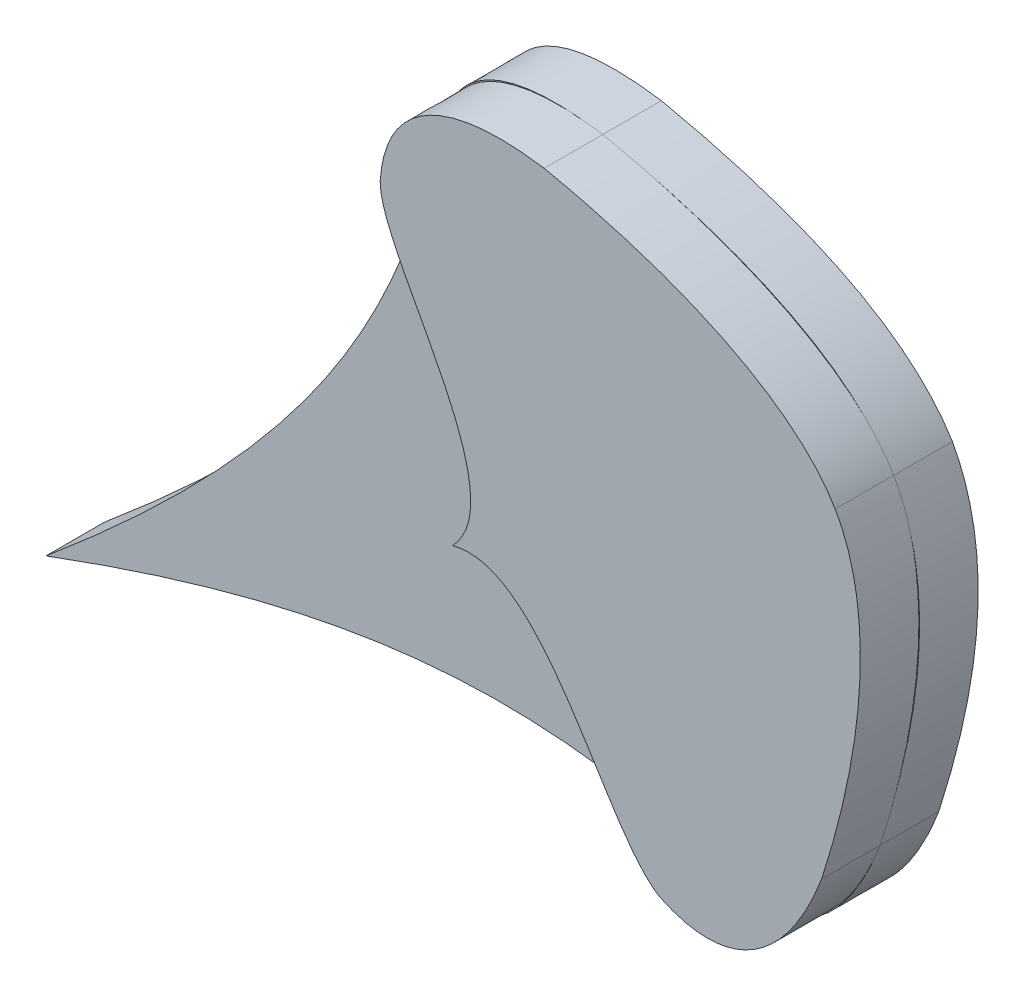
ISO-10303-21;
HEADER;
FILE_DESCRIPTION(('STEP AP214'),'2;1');
FILE_NAME('part.step','',(''),(''),'','','');
FILE_SCHEMA(('AUTOMOTIVE_DESIGN { 1 0 10303 214 1 1 1 1 }'));
ENDSEC;
DATA;
#1=APPLICATION_CONTEXT('core data for automotive mechanical design processes');
#2=APPLICATION_PROTOCOL_DEFINITION('international standard','automotive_design',2000,#1);
#3=PRODUCT_CONTEXT('',#1,'mechanical');
#4=PRODUCT('Part','Part','',(#3));
#5=PRODUCT_RELATED_PRODUCT_CATEGORY('part','',(#4));
#6=PRODUCT_DEFINITION_FORMATION('','',#4);
#7=PRODUCT_DEFINITION_CONTEXT('part definition',#1,'design');
#8=PRODUCT_DEFINITION('design','',#6,#7);
#9=PRODUCT_DEFINITION_SHAPE('','',#8);
#10=(LENGTH_UNIT() NAMED_UNIT(*) SI_UNIT(.MILLI.,.METRE.));
#11=(NAMED_UNIT(*) PLANE_ANGLE_UNIT() SI_UNIT($,.RADIAN.));
#12=(NAMED_UNIT(*) SI_UNIT($,.STERADIAN.) SOLID_ANGLE_UNIT());
#13=UNCERTAINTY_MEASURE_WITH_UNIT(LENGTH_MEASURE(1.E-05),#10,'distance_accuracy_value','');
#14=(GEOMETRIC_REPRESENTATION_CONTEXT(3) GLOBAL_UNCERTAINTY_ASSIGNED_CONTEXT((#13)) GLOBAL_UNIT_ASSIGNED_CONTEXT((#10,
#11,#12)) REPRESENTATION_CONTEXT('',''));
#15=CARTESIAN_POINT('',(0.,0.,0.));
#16=DIRECTION('',(0.,0.,1.));
#17=DIRECTION('',(1.,0.,0.));
#18=AXIS2_PLACEMENT_3D('',#15,#16,#17);
#19=CARTESIAN_POINT('',(1091.5346594344,817.810461858277,10.));
#20=DIRECTION('',(0.,0.,1.));
#21=DIRECTION('',(1.,0.,0.));
#22=AXIS2_PLACEMENT_3D('',#19,#20,#21);
#23=PLANE('',#22);
#24=CARTESIAN_POINT('',(1084.89126533636,784.788556570693,10.));
#25=CARTESIAN_POINT('',(1093.52222440277,811.75798322808,10.));
#26=CARTESIAN_POINT('',(1093.01439360262,830.735257407287,10.));
#27=CARTESIAN_POINT('',(1087.18778082483,840.595865039812,10.));
#28=B_SPLINE_CURVE_WITH_KNOTS('',3,(#24,#25,#26,#27),.UNSPECIFIED.,.F.,.F.,(4,4),(0.,1.),.UNSPECIFIED.);
#29=CARTESIAN_POINT('',(1086.50027911747,790.087891008953,10.));
#30=VERTEX_POINT('',#29);
#31=CARTESIAN_POINT('',(1090.06138700975,833.416297835862,10.));
#32=VERTEX_POINT('',#31);
#33=EDGE_CURVE('E11',#30,#32,#28,.T.);
#34=ORIENTED_EDGE('',*,*,#33,.F.);
#35=CARTESIAN_POINT('',(1084.89126533636,784.788556570693,10.));
#36=CARTESIAN_POINT('',(1097.0297957882,822.928712911301,10.));
#37=CARTESIAN_POINT('',(1087.18778082483,840.595865039812,10.));
#38=B_SPLINE_CURVE_WITH_KNOTS('',2,(#35,#36,#37),.UNSPECIFIED.,.F.,.F.,(3,3),(0.,1.),.UNSPECIFIED.);
#39=EDGE_CURVE('E39',#30,#32,#38,.T.);
#40=ORIENTED_EDGE('',*,*,#39,.T.);
#41=EDGE_LOOP('',(#34,#40));
#42=FACE_BOUND('',#41,.T.);
#43=ADVANCED_FACE('F33',(#42),#23,.T.);
#44=CARTESIAN_POINT('',(1057.30158871609,768.260369991355,10.));
#45=CARTESIAN_POINT('',(1068.39381800838,762.911936442552,10.));
#46=CARTESIAN_POINT('',(1078.57410115042,768.238078014027,10.));
#47=CARTESIAN_POINT('',(1084.89126533636,784.788556570693,10.));
#48=B_SPLINE_CURVE_WITH_KNOTS('',3,(#44,#45,#46,#47),.UNSPECIFIED.,.F.,.F.,(4,4),(0.,1.),.UNSPECIFIED.);
#49=CARTESIAN_POINT('',(1063.62607334976,766.357587399792,10.));
#50=VERTEX_POINT('',#49);
#51=CARTESIAN_POINT('',(1083.83897315551,782.215562819125,10.));
#52=VERTEX_POINT('',#51);
#53=EDGE_CURVE('E44',#50,#52,#48,.T.);
#54=ORIENTED_EDGE('',*,*,#53,.F.);
#55=CARTESIAN_POINT('',(1057.30158871609,768.260369991355,10.));
#56=CARTESIAN_POINT('',(1075.36566558913,760.045488284607,10.));
#57=CARTESIAN_POINT('',(1084.89126533636,784.788556570693,10.));
#58=B_SPLINE_CURVE_WITH_KNOTS('',2,(#55,#56,#57),.UNSPECIFIED.,.F.,.F.,(3,3),(0.,1.),.UNSPECIFIED.);
#59=EDGE_CURVE('E414',#50,#52,#58,.T.);
#60=ORIENTED_EDGE('',*,*,#59,.T.);
#61=EDGE_LOOP('',(#54,#60));
#62=FACE_BOUND('',#61,.T.);
#63=ADVANCED_FACE('F484',(#62),#23,.T.);
#64=CARTESIAN_POINT('',(1021.86335653294,802.554480195239,10.));
#65=CARTESIAN_POINT('',(1037.75529903201,806.75725398034,10.));
#66=CARTESIAN_POINT('',(1047.91521963167,773.390697705357,10.));
#67=CARTESIAN_POINT('',(1057.30158871609,768.260369991355,10.));
#68=B_SPLINE_CURVE_WITH_KNOTS('',3,(#64,#65,#66,#67),.UNSPECIFIED.,.F.,.F.,(4,4),(0.,1.),.UNSPECIFIED.);
#69=CARTESIAN_POINT('',(1021.86335653294,802.554480195239,10.));
#70=VERTEX_POINT('',#69);
#71=CARTESIAN_POINT('',(1057.30158871609,768.260369991355,10.));
#72=VERTEX_POINT('',#71);
#73=EDGE_CURVE('E51',#70,#72,#68,.T.);
#74=ORIENTED_EDGE('',*,*,#73,.F.);
#75=CARTESIAN_POINT('',(1009.52557635658,850.301034785731,10.));
#76=CARTESIAN_POINT('',(1009.35534743589,839.605465181608,10.));
#77=CARTESIAN_POINT('',(1033.36152518063,814.30221451433,10.));
#78=CARTESIAN_POINT('',(1021.86335653294,802.554480195239,10.));
#79=B_SPLINE_CURVE_WITH_KNOTS('',3,(#75,#76,#77,#78),.UNSPECIFIED.,.F.,.F.,(4,4),(0.,1.),.UNSPECIFIED.);
#80=CARTESIAN_POINT('',(1009.52557635658,850.301034785731,10.));
#81=VERTEX_POINT('',#80);
#82=EDGE_CURVE('E449',#81,#70,#79,.T.);
#83=ORIENTED_EDGE('',*,*,#82,.F.);
#84=CARTESIAN_POINT('',(1009.52557635658,850.301034785731,10.));
#85=CARTESIAN_POINT('',(1001.90734281833,820.670179881632,10.));
#86=CARTESIAN_POINT('',(988.206449115251,794.709110120853,10.));
#87=CARTESIAN_POINT('',(942.482736762988,756.327533098448,10.));
#88=B_SPLINE_CURVE_WITH_KNOTS('',3,(#84,#85,#86,#87),.UNSPECIFIED.,.F.,.F.,(4,4),(0.,1.),.UNSPECIFIED.);
#89=CARTESIAN_POINT('',(942.482736762988,756.327533098448,10.));
#90=VERTEX_POINT('',#89);
#91=EDGE_CURVE('E270',#81,#90,#88,.T.);
#92=ORIENTED_EDGE('',*,*,#91,.T.);
#93=CARTESIAN_POINT('',(942.482736762988,756.327533098448,10.));
#94=CARTESIAN_POINT('',(998.429870334372,777.153516175964,10.));
#95=CARTESIAN_POINT('',(1027.77078121499,776.257647835978,10.));
#96=CARTESIAN_POINT('',(1057.30158871609,768.260369991355,10.));
#97=B_SPLINE_CURVE_WITH_KNOTS('',3,(#93,#94,#95,#96),.UNSPECIFIED.,.F.,.F.,(4,4),(0.,1.),.UNSPECIFIED.);
#98=EDGE_CURVE('E415',#90,#72,#97,.T.);
#99=ORIENTED_EDGE('',*,*,#98,.T.);
#100=EDGE_LOOP('',(#74,#83,#92,#99));
#101=FACE_BOUND('',#100,.T.);
#102=ADVANCED_FACE('F486',(#101),#23,.T.);
#103=CARTESIAN_POINT('',(1037.51660506411,866.14002211152,10.));
#104=CARTESIAN_POINT('',(1020.00440956792,868.813580173374,10.));
#105=CARTESIAN_POINT('',(1010.34797100117,862.587896026391,10.));
#106=CARTESIAN_POINT('',(1009.52557635658,850.301034785731,10.));
#107=B_SPLINE_CURVE_WITH_KNOTS('',3,(#103,#104,#105,#106),.UNSPECIFIED.,.F.,.F.,(4,4),(0.,1.),.UNSPECIFIED.);
#108=CARTESIAN_POINT('',(1034.75945290657,866.494603076725,10.));
#109=VERTEX_POINT('',#108);
#110=CARTESIAN_POINT('',(1010.99185469306,856.740733172445,10.));
#111=VERTEX_POINT('',#110);
#112=EDGE_CURVE('E304',#109,#111,#107,.T.);
#113=ORIENTED_EDGE('',*,*,#112,.F.);
#114=CARTESIAN_POINT('',(1037.51660506411,866.14002211152,10.));
#115=CARTESIAN_POINT('',(1011.29559215513,870.066211202949,10.));
#116=CARTESIAN_POINT('',(1009.52557635658,850.301034785731,10.));
#117=B_SPLINE_CURVE_WITH_KNOTS('',2,(#114,#115,#116),.UNSPECIFIED.,.F.,.F.,(3,3),(0.,1.),.UNSPECIFIED.);
#118=EDGE_CURVE('E300',#109,#111,#117,.T.);
#119=ORIENTED_EDGE('',*,*,#118,.T.);
#120=EDGE_LOOP('',(#113,#119));
#121=FACE_BOUND('',#120,.T.);
#122=ADVANCED_FACE('F478',(#121),#23,.T.);
#123=DIRECTION('',(0.,0.,-1.));
#124=VECTOR('',#123,1.);
#125=SURFACE_OF_LINEAR_EXTRUSION('',#38,#124);
#126=CARTESIAN_POINT('',(1084.89126533636,784.788556570693,0.));
#127=CARTESIAN_POINT('',(1097.0297957882,822.928712911301,0.));
#128=CARTESIAN_POINT('',(1087.18778082483,840.595865039812,0.));
#129=B_SPLINE_CURVE_WITH_KNOTS('',2,(#126,#127,#128),.UNSPECIFIED.,.F.,.F.,(3,3),(0.,1.),.UNSPECIFIED.);
#130=CARTESIAN_POINT('',(1084.89126533636,784.788556570693,0.));
#131=VERTEX_POINT('',#130);
#132=CARTESIAN_POINT('',(1087.18778082483,840.595865039812,0.));
#133=VERTEX_POINT('',#132);
#134=EDGE_CURVE('E165',#131,#133,#129,.T.);
#135=ORIENTED_EDGE('',*,*,#134,.T.);
#136=DIRECTION('',(0.,0.,-1.));
#137=VECTOR('',#136,1.);
#138=CARTESIAN_POINT('',(1087.18778082483,840.595865039812,10.));
#139=LINE('',#138,#137);
#140=CARTESIAN_POINT('',(1087.18778082483,840.595865039812,10.));
#141=VERTEX_POINT('',#140);
#142=EDGE_CURVE('E377',#141,#133,#139,.T.);
#143=ORIENTED_EDGE('',*,*,#142,.F.);
#144=EDGE_CURVE('E179',#32,#141,#38,.T.);
#145=ORIENTED_EDGE('',*,*,#144,.F.);
#146=ORIENTED_EDGE('',*,*,#39,.F.);
#147=CARTESIAN_POINT('',(1084.89126533636,784.788556570693,10.));
#148=CARTESIAN_POINT('',(1085.46803325688,786.590801258792,10.));
#149=CARTESIAN_POINT('',(1086.00399059692,788.357355840586,10.));
#150=CARTESIAN_POINT('',(1086.50027731851,790.087884739982,10.));
#151=B_SPLINE_CURVE_WITH_KNOTS('',3,(#147,#148,#149,#150),.UNSPECIFIED.,.F.,.F.,(4,4),(0.,
0.0668254728212872),.UNSPECIFIED.);
#152=CARTESIAN_POINT('',(1084.89126533636,784.788556570693,10.));
#153=VERTEX_POINT('',#152);
#154=EDGE_CURVE('E251',#153,#30,#151,.T.);
#155=ORIENTED_EDGE('',*,*,#154,.F.);
#156=DIRECTION('',(0.,0.,-1.));
#157=VECTOR('',#156,1.);
#158=CARTESIAN_POINT('',(1084.89126533636,784.788556570693,10.));
#159=LINE('',#158,#157);
#160=EDGE_CURVE('E413',#153,#131,#159,.T.);
#161=ORIENTED_EDGE('',*,*,#160,.T.);
#162=EDGE_LOOP('',(#135,#143,#145,#146,#155,#161));
#163=FACE_BOUND('',#162,.T.);
#164=ADVANCED_FACE('F35',(#163),#125,.F.);
#165=CARTESIAN_POINT('',(1087.18778082483,840.595865039812,10.));
#166=CARTESIAN_POINT('',(1076.6791048201,857.874790107618,10.));
#167=CARTESIAN_POINT('',(1037.51660506411,866.14002211152,10.));
#168=B_SPLINE_CURVE_WITH_KNOTS('',2,(#165,#166,#167),.UNSPECIFIED.,.F.,.F.,(3,3),(0.,1.),.UNSPECIFIED.);
#169=DIRECTION('',(0.,0.,-1.));
#170=VECTOR('',#169,1.);
#171=SURFACE_OF_LINEAR_EXTRUSION('',#168,#170);
#172=CARTESIAN_POINT('',(1087.18778082483,840.595865039812,0.));
#173=CARTESIAN_POINT('',(1076.6791048201,857.874790107618,0.));
#174=CARTESIAN_POINT('',(1037.51660506411,866.14002211152,0.));
#175=B_SPLINE_CURVE_WITH_KNOTS('',2,(#172,#173,#174),.UNSPECIFIED.,.F.,.F.,(3,3),(0.,1.),.UNSPECIFIED.);
#176=CARTESIAN_POINT('',(1037.51660506411,866.14002211152,0.));
#177=VERTEX_POINT('',#176);
#178=EDGE_CURVE('E168',#133,#177,#175,.T.);
#179=ORIENTED_EDGE('',*,*,#178,.T.);
#180=DIRECTION('',(0.,0.,-1.));
#181=VECTOR('',#180,1.);
#182=CARTESIAN_POINT('',(1037.51660506411,866.14002211152,10.));
#183=LINE('',#182,#181);
#184=CARTESIAN_POINT('',(1037.51660506411,866.14002211152,10.));
#185=VERTEX_POINT('',#184);
#186=EDGE_CURVE('E379',#185,#177,#183,.T.);
#187=ORIENTED_EDGE('',*,*,#186,.F.);
#188=CARTESIAN_POINT('',(1042.91970533106,864.9241659903,10.));
#189=CARTESIAN_POINT('',(1041.16967299864,865.346561086032,10.));
#190=CARTESIAN_POINT('',(1039.36872981637,865.752232153277,10.));
#191=CARTESIAN_POINT('',(1037.51660506411,866.14002211152,10.));
#192=B_SPLINE_CURVE_WITH_KNOTS('',3,(#188,#189,#190,#191),.UNSPECIFIED.,.F.,.F.,(4,4),
(0.933174527181268,1.),.UNSPECIFIED.);
#193=CARTESIAN_POINT('',(1042.91970533106,864.9241659903,10.));
#194=VERTEX_POINT('',#193);
#195=EDGE_CURVE('E256',#194,#185,#192,.T.);
#196=ORIENTED_EDGE('',*,*,#195,.F.);
#197=CARTESIAN_POINT('',(1082.3615843341,846.638350056223,10.));
#198=VERTEX_POINT('',#197);
#199=EDGE_CURVE('E252',#198,#194,#168,.T.);
#200=ORIENTED_EDGE('',*,*,#199,.F.);
#201=EDGE_CURVE('E255',#141,#198,#168,.T.);
#202=ORIENTED_EDGE('',*,*,#201,.F.);
#203=ORIENTED_EDGE('',*,*,#142,.T.);
#204=EDGE_LOOP('',(#179,#187,#196,#200,#202,#203));
#205=FACE_BOUND('',#204,.T.);
#206=ADVANCED_FACE('F279',(#205),#171,.F.);
#207=DIRECTION('',(0.,0.,-1.));
#208=VECTOR('',#207,1.);
#209=SURFACE_OF_LINEAR_EXTRUSION('',#117,#208);
#210=CARTESIAN_POINT('',(1037.51660506411,866.14002211152,0.));
#211=CARTESIAN_POINT('',(1011.29559215513,870.066211202949,0.));
#212=CARTESIAN_POINT('',(1009.52557635658,850.301034785731,0.));
#213=B_SPLINE_CURVE_WITH_KNOTS('',2,(#210,#211,#212),.UNSPECIFIED.,.F.,.F.,(3,3),(0.,1.),.UNSPECIFIED.);
#214=CARTESIAN_POINT('',(1009.52557635658,850.301034785731,0.));
#215=VERTEX_POINT('',#214);
#216=EDGE_CURVE('E656',#177,#215,#213,.T.);
#217=ORIENTED_EDGE('',*,*,#216,.T.);
#218=DIRECTION('',(0.,0.,-1.));
#219=VECTOR('',#218,1.);
#220=CARTESIAN_POINT('',(1009.52557635658,850.301034785731,10.));
#221=LINE('',#220,#219);
#222=EDGE_CURVE('E382',#81,#215,#221,.T.);
#223=ORIENTED_EDGE('',*,*,#222,.F.);
#224=EDGE_CURVE('E265',#111,#81,#117,.T.);
#225=ORIENTED_EDGE('',*,*,#224,.F.);
#226=ORIENTED_EDGE('',*,*,#118,.F.);
#227=CARTESIAN_POINT('',(1037.51660506411,866.14002211152,10.));
#228=CARTESIAN_POINT('',(1036.57478185847,866.283808710113,10.));
#229=CARTESIAN_POINT('',(1035.65568060373,866.401855186343,10.));
#230=CARTESIAN_POINT('',(1034.75945347818,866.494603017862,10.));
#231=B_SPLINE_CURVE_WITH_KNOTS('',3,(#227,#228,#229,#230),.UNSPECIFIED.,.F.,.F.,(4,4),(0.,
0.0537809897023282),.UNSPECIFIED.);
#232=EDGE_CURVE('E303',#185,#109,#231,.T.);
#233=ORIENTED_EDGE('',*,*,#232,.F.);
#234=ORIENTED_EDGE('',*,*,#186,.T.);
#235=EDGE_LOOP('',(#217,#223,#225,#226,#233,#234));
#236=FACE_BOUND('',#235,.T.);
#237=ADVANCED_FACE('F283',(#236),#209,.F.);
#238=DIRECTION('',(0.,0.,-1.));
#239=VECTOR('',#238,1.);
#240=SURFACE_OF_LINEAR_EXTRUSION('',#88,#239);
#241=CARTESIAN_POINT('',(1009.52557635658,850.301034785731,0.));
#242=CARTESIAN_POINT('',(1001.90734281833,820.670179881632,0.));
#243=CARTESIAN_POINT('',(988.206449115251,794.709110120853,0.));
#244=CARTESIAN_POINT('',(942.482736762988,756.327533098448,0.));
#245=B_SPLINE_CURVE_WITH_KNOTS('',3,(#241,#242,#243,#244),.UNSPECIFIED.,.F.,.F.,(4,4),(0.,1.),.UNSPECIFIED.);
#246=CARTESIAN_POINT('',(942.482736762988,756.327533098448,0.));
#247=VERTEX_POINT('',#246);
#248=EDGE_CURVE('E648',#215,#247,#245,.T.);
#249=ORIENTED_EDGE('',*,*,#248,.T.);
#250=DIRECTION('',(0.,0.,-1.));
#251=VECTOR('',#250,1.);
#252=CARTESIAN_POINT('',(942.482736762988,756.327533098448,10.));
#253=LINE('',#252,#251);
#254=EDGE_CURVE('E651',#90,#247,#253,.T.);
#255=ORIENTED_EDGE('',*,*,#254,.F.);
#256=ORIENTED_EDGE('',*,*,#91,.F.);
#257=ORIENTED_EDGE('',*,*,#222,.T.);
#258=EDGE_LOOP('',(#249,#255,#256,#257));
#259=FACE_BOUND('',#258,.T.);
#260=ADVANCED_FACE('F615',(#259),#240,.F.);
#261=DIRECTION('',(0.,0.,-1.));
#262=VECTOR('',#261,1.);
#263=SURFACE_OF_LINEAR_EXTRUSION('',#97,#262);
#264=CARTESIAN_POINT('',(942.482736762988,756.327533098448,0.));
#265=CARTESIAN_POINT('',(998.429870334372,777.153516175964,0.));
#266=CARTESIAN_POINT('',(1027.77078121499,776.257647835978,0.));
#267=CARTESIAN_POINT('',(1057.30158871609,768.260369991355,0.));
#268=B_SPLINE_CURVE_WITH_KNOTS('',3,(#264,#265,#266,#267),.UNSPECIFIED.,.F.,.F.,(4,4),(0.,1.),.UNSPECIFIED.);
#269=CARTESIAN_POINT('',(1057.30158871609,768.260369991355,0.));
#270=VERTEX_POINT('',#269);
#271=EDGE_CURVE('E655',#247,#270,#268,.T.);
#272=ORIENTED_EDGE('',*,*,#271,.T.);
#273=DIRECTION('',(0.,0.,-1.));
#274=VECTOR('',#273,1.);
#275=CARTESIAN_POINT('',(1057.30158871609,768.260369991355,10.));
#276=LINE('',#275,#274);
#277=EDGE_CURVE('E428',#72,#270,#276,.T.);
#278=ORIENTED_EDGE('',*,*,#277,.F.);
#279=ORIENTED_EDGE('',*,*,#98,.F.);
#280=ORIENTED_EDGE('',*,*,#254,.T.);
#281=EDGE_LOOP('',(#272,#278,#279,#280));
#282=FACE_BOUND('',#281,.T.);
#283=ADVANCED_FACE('F405',(#282),#263,.F.);
#284=DIRECTION('',(0.,0.,-1.));
#285=VECTOR('',#284,1.);
#286=SURFACE_OF_LINEAR_EXTRUSION('',#58,#285);
#287=CARTESIAN_POINT('',(1057.30158871609,768.260369991355,0.));
#288=CARTESIAN_POINT('',(1075.36566558913,760.045488284607,0.));
#289=CARTESIAN_POINT('',(1084.89126533636,784.788556570693,0.));
#290=B_SPLINE_CURVE_WITH_KNOTS('',2,(#287,#288,#289),.UNSPECIFIED.,.F.,.F.,(3,3),(0.,1.),.UNSPECIFIED.);
#291=EDGE_CURVE('E185',#270,#131,#290,.T.);
#292=ORIENTED_EDGE('',*,*,#291,.T.);
#293=ORIENTED_EDGE('',*,*,#160,.F.);
#294=CARTESIAN_POINT('',(1083.8389733864,782.215563345292,10.));
#295=CARTESIAN_POINT('',(1084.20060498696,783.040819551687,10.));
#296=CARTESIAN_POINT('',(1084.55152199435,783.898455453928,10.));
#297=CARTESIAN_POINT('',(1084.89126533636,784.788556570693,10.));
#298=B_SPLINE_CURVE_WITH_KNOTS('',3,(#294,#295,#296,#297),.UNSPECIFIED.,.F.,.F.,(4,4),
(0.946219010301278,1.),.UNSPECIFIED.);
#299=EDGE_CURVE('E59',#52,#153,#298,.T.);
#300=ORIENTED_EDGE('',*,*,#299,.F.);
#301=ORIENTED_EDGE('',*,*,#59,.F.);
#302=EDGE_CURVE('E408',#72,#50,#58,.T.);
#303=ORIENTED_EDGE('',*,*,#302,.F.);
#304=ORIENTED_EDGE('',*,*,#277,.T.);
#305=EDGE_LOOP('',(#292,#293,#300,#301,#303,#304));
#306=FACE_BOUND('',#305,.T.);
#307=ADVANCED_FACE('F393',(#306),#286,.F.);
#308=CARTESIAN_POINT('',(1087.18778082483,840.595865039812,10.));
#309=CARTESIAN_POINT('',(1081.48711919672,850.529819758184,10.));
#310=CARTESIAN_POINT('',(1065.23245463665,860.336996081378,10.));
#311=CARTESIAN_POINT('',(1037.51660506411,866.14002211152,10.));
#312=B_SPLINE_CURVE_WITH_KNOTS('',3,(#308,#309,#310,#311),.UNSPECIFIED.,.F.,.F.,(4,4),(0.,1.),.UNSPECIFIED.);
#313=EDGE_CURVE('E257',#198,#194,#312,.T.);
#314=ORIENTED_EDGE('',*,*,#313,.F.);
#315=ORIENTED_EDGE('',*,*,#199,.T.);
#316=EDGE_LOOP('',(#314,#315));
#317=FACE_BOUND('',#316,.T.);
#318=ADVANCED_FACE('F404',(#317),#23,.T.);
#319=CARTESIAN_POINT('',(1091.5346594344,817.810461858277,0.));
#320=DIRECTION('',(0.,0.,1.));
#321=DIRECTION('',(1.,0.,0.));
#322=AXIS2_PLACEMENT_3D('',#319,#320,#321);
#323=PLANE('',#322);
#324=ORIENTED_EDGE('',*,*,#134,.F.);
#325=ORIENTED_EDGE('',*,*,#291,.F.);
#326=ORIENTED_EDGE('',*,*,#271,.F.);
#327=ORIENTED_EDGE('',*,*,#248,.F.);
#328=ORIENTED_EDGE('',*,*,#216,.F.);
#329=ORIENTED_EDGE('',*,*,#178,.F.);
#330=EDGE_LOOP('',(#324,#325,#326,#327,#328,#329));
#331=FACE_BOUND('',#330,.T.);
#332=ADVANCED_FACE('F406',(#331),#323,.F.);
#333=CARTESIAN_POINT('',(1091.46111252217,819.108017939576,10.));
#334=DIRECTION('',(0.,0.,1.));
#335=DIRECTION('',(1.,0.,0.));
#336=AXIS2_PLACEMENT_3D('',#333,#334,#335);
#337=PLANE('',#336);
#338=EDGE_CURVE('E163',#32,#141,#28,.T.);
#339=ORIENTED_EDGE('',*,*,#338,.F.);
#340=ORIENTED_EDGE('',*,*,#144,.T.);
#341=EDGE_LOOP('',(#339,#340));
#342=FACE_BOUND('',#341,.T.);
#343=ADVANCED_FACE('F209',(#342),#337,.F.);
#344=EDGE_CURVE('E229',#141,#198,#312,.T.);
#345=ORIENTED_EDGE('',*,*,#344,.F.);
#346=ORIENTED_EDGE('',*,*,#201,.T.);
#347=EDGE_LOOP('',(#345,#346));
#348=FACE_BOUND('',#347,.T.);
#349=ADVANCED_FACE('F475',(#348),#337,.F.);
#350=EDGE_CURVE('E447',#111,#81,#107,.T.);
#351=ORIENTED_EDGE('',*,*,#350,.F.);
#352=ORIENTED_EDGE('',*,*,#224,.T.);
#353=EDGE_LOOP('',(#351,#352));
#354=FACE_BOUND('',#353,.T.);
#355=ADVANCED_FACE('F498',(#354),#337,.F.);
#356=EDGE_CURVE('E157',#72,#50,#48,.T.);
#357=ORIENTED_EDGE('',*,*,#356,.F.);
#358=ORIENTED_EDGE('',*,*,#302,.T.);
#359=EDGE_LOOP('',(#357,#358));
#360=FACE_BOUND('',#359,.T.);
#361=ADVANCED_FACE('F496',(#360),#337,.F.);
#362=CARTESIAN_POINT('',(1084.89126533636,784.788556570693,20.));
#363=CARTESIAN_POINT('',(1093.52222440277,811.75798322808,20.));
#364=CARTESIAN_POINT('',(1093.01439360262,830.735257407287,20.));
#365=CARTESIAN_POINT('',(1087.18778082483,840.595865039812,20.));
#366=B_SPLINE_CURVE_WITH_KNOTS('',3,(#362,#363,#364,#365),.UNSPECIFIED.,.F.,.F.,(4,4),(0.,1.),.UNSPECIFIED.);
#367=DIRECTION('',(0.,0.,-1.));
#368=VECTOR('',#367,1.);
#369=SURFACE_OF_LINEAR_EXTRUSION('',#366,#368);
#370=ORIENTED_EDGE('',*,*,#154,.T.);
#371=ORIENTED_EDGE('',*,*,#33,.T.);
#372=ORIENTED_EDGE('',*,*,#338,.T.);
#373=DIRECTION('',(0.,0.,-1.));
#374=VECTOR('',#373,1.);
#375=CARTESIAN_POINT('',(1087.18778082483,840.595865039812,20.));
#376=LINE('',#375,#374);
#377=CARTESIAN_POINT('',(1087.18778082483,840.595865039812,20.));
#378=VERTEX_POINT('',#377);
#379=EDGE_CURVE('E141',#378,#141,#376,.T.);
#380=ORIENTED_EDGE('',*,*,#379,.F.);
#381=CARTESIAN_POINT('',(1084.89126533636,784.788556570693,20.));
#382=VERTEX_POINT('',#381);
#383=EDGE_CURVE('E148',#382,#378,#366,.T.);
#384=ORIENTED_EDGE('',*,*,#383,.F.);
#385=DIRECTION('',(0.,0.,-1.));
#386=VECTOR('',#385,1.);
#387=CARTESIAN_POINT('',(1084.89126533636,784.788556570693,20.));
#388=LINE('',#387,#386);
#389=EDGE_CURVE('E175',#382,#153,#388,.T.);
#390=ORIENTED_EDGE('',*,*,#389,.T.);
#391=EDGE_LOOP('',(#370,#371,#372,#380,#384,#390));
#392=FACE_BOUND('',#391,.T.);
#393=ADVANCED_FACE('F161',(#392),#369,.F.);
#394=CARTESIAN_POINT('',(1087.18778082483,840.595865039812,20.));
#395=CARTESIAN_POINT('',(1081.48711919672,850.529819758184,20.));
#396=CARTESIAN_POINT('',(1065.23245463665,860.336996081378,20.));
#397=CARTESIAN_POINT('',(1037.51660506411,866.14002211152,20.));
#398=B_SPLINE_CURVE_WITH_KNOTS('',3,(#394,#395,#396,#397),.UNSPECIFIED.,.F.,.F.,(4,4),(0.,1.),.UNSPECIFIED.);
#399=DIRECTION('',(0.,0.,-1.));
#400=VECTOR('',#399,1.);
#401=SURFACE_OF_LINEAR_EXTRUSION('',#398,#400);
#402=ORIENTED_EDGE('',*,*,#344,.T.);
#403=ORIENTED_EDGE('',*,*,#313,.T.);
#404=ORIENTED_EDGE('',*,*,#195,.T.);
#405=DIRECTION('',(0.,0.,-1.));
#406=VECTOR('',#405,1.);
#407=CARTESIAN_POINT('',(1037.51660506411,866.14002211152,20.));
#408=LINE('',#407,#406);
#409=CARTESIAN_POINT('',(1037.51660506411,866.14002211152,20.));
#410=VERTEX_POINT('',#409);
#411=EDGE_CURVE('E144',#410,#185,#408,.T.);
#412=ORIENTED_EDGE('',*,*,#411,.F.);
#413=EDGE_CURVE('E136',#378,#410,#398,.T.);
#414=ORIENTED_EDGE('',*,*,#413,.F.);
#415=ORIENTED_EDGE('',*,*,#379,.T.);
#416=EDGE_LOOP('',(#402,#403,#404,#412,#414,#415));
#417=FACE_BOUND('',#416,.T.);
#418=ADVANCED_FACE('F139',(#417),#401,.F.);
#419=CARTESIAN_POINT('',(1037.51660506411,866.14002211152,20.));
#420=CARTESIAN_POINT('',(1020.00440956792,868.813580173374,20.));
#421=CARTESIAN_POINT('',(1010.34797100117,862.587896026391,20.));
#422=CARTESIAN_POINT('',(1009.52557635658,850.301034785731,20.));
#423=B_SPLINE_CURVE_WITH_KNOTS('',3,(#419,#420,#421,#422),.UNSPECIFIED.,.F.,.F.,(4,4),(0.,1.),.UNSPECIFIED.);
#424=DIRECTION('',(0.,0.,-1.));
#425=VECTOR('',#424,1.);
#426=SURFACE_OF_LINEAR_EXTRUSION('',#423,#425);
#427=ORIENTED_EDGE('',*,*,#232,.T.);
#428=ORIENTED_EDGE('',*,*,#112,.T.);
#429=ORIENTED_EDGE('',*,*,#350,.T.);
#430=DIRECTION('',(0.,0.,-1.));
#431=VECTOR('',#430,1.);
#432=CARTESIAN_POINT('',(1009.52557635658,850.301034785731,20.));
#433=LINE('',#432,#431);
#434=CARTESIAN_POINT('',(1009.52557635658,850.301034785731,20.));
#435=VERTEX_POINT('',#434);
#436=EDGE_CURVE('E170',#435,#81,#433,.T.);
#437=ORIENTED_EDGE('',*,*,#436,.F.);
#438=EDGE_CURVE('E147',#410,#435,#423,.T.);
#439=ORIENTED_EDGE('',*,*,#438,.F.);
#440=ORIENTED_EDGE('',*,*,#411,.T.);
#441=EDGE_LOOP('',(#427,#428,#429,#437,#439,#440));
#442=FACE_BOUND('',#441,.T.);
#443=ADVANCED_FACE('F326',(#442),#426,.F.);
#444=CARTESIAN_POINT('',(1009.52557635658,850.301034785731,20.));
#445=CARTESIAN_POINT('',(1009.35534743589,839.605465181608,20.));
#446=CARTESIAN_POINT('',(1033.36152518063,814.30221451433,20.));
#447=CARTESIAN_POINT('',(1021.86335653294,802.554480195239,20.));
#448=B_SPLINE_CURVE_WITH_KNOTS('',3,(#444,#445,#446,#447),.UNSPECIFIED.,.F.,.F.,(4,4),(0.,1.),.UNSPECIFIED.);
#449=DIRECTION('',(0.,0.,-1.));
#450=VECTOR('',#449,1.);
#451=SURFACE_OF_LINEAR_EXTRUSION('',#448,#450);
#452=ORIENTED_EDGE('',*,*,#82,.T.);
#453=DIRECTION('',(0.,0.,-1.));
#454=VECTOR('',#453,1.);
#455=CARTESIAN_POINT('',(1021.86335653294,802.554480195239,20.));
#456=LINE('',#455,#454);
#457=CARTESIAN_POINT('',(1021.86335653294,802.554480195239,20.));
#458=VERTEX_POINT('',#457);
#459=EDGE_CURVE('E363',#458,#70,#456,.T.);
#460=ORIENTED_EDGE('',*,*,#459,.F.);
#461=EDGE_CURVE('E341',#435,#458,#448,.T.);
#462=ORIENTED_EDGE('',*,*,#461,.F.);
#463=ORIENTED_EDGE('',*,*,#436,.T.);
#464=EDGE_LOOP('',(#452,#460,#462,#463));
#465=FACE_BOUND('',#464,.T.);
#466=ADVANCED_FACE('F336',(#465),#451,.F.);
#467=CARTESIAN_POINT('',(1021.86335653294,802.554480195239,20.));
#468=CARTESIAN_POINT('',(1037.75529903201,806.75725398034,20.));
#469=CARTESIAN_POINT('',(1047.91521963167,773.390697705357,20.));
#470=CARTESIAN_POINT('',(1057.30158871609,768.260369991355,20.));
#471=B_SPLINE_CURVE_WITH_KNOTS('',3,(#467,#468,#469,#470),.UNSPECIFIED.,.F.,.F.,(4,4),(0.,1.),.UNSPECIFIED.);
#472=DIRECTION('',(0.,0.,-1.));
#473=VECTOR('',#472,1.);
#474=SURFACE_OF_LINEAR_EXTRUSION('',#471,#473);
#475=ORIENTED_EDGE('',*,*,#73,.T.);
#476=DIRECTION('',(0.,0.,-1.));
#477=VECTOR('',#476,1.);
#478=CARTESIAN_POINT('',(1057.30158871609,768.260369991355,20.));
#479=LINE('',#478,#477);
#480=CARTESIAN_POINT('',(1057.30158871609,768.260369991355,20.));
#481=VERTEX_POINT('',#480);
#482=EDGE_CURVE('E177',#481,#72,#479,.T.);
#483=ORIENTED_EDGE('',*,*,#482,.F.);
#484=EDGE_CURVE('E217',#458,#481,#471,.T.);
#485=ORIENTED_EDGE('',*,*,#484,.F.);
#486=ORIENTED_EDGE('',*,*,#459,.T.);
#487=EDGE_LOOP('',(#475,#483,#485,#486));
#488=FACE_BOUND('',#487,.T.);
#489=ADVANCED_FACE('F208',(#488),#474,.F.);
#490=CARTESIAN_POINT('',(1057.30158871609,768.260369991355,20.));
#491=CARTESIAN_POINT('',(1068.39381800838,762.911936442552,20.));
#492=CARTESIAN_POINT('',(1078.57410115042,768.238078014027,20.));
#493=CARTESIAN_POINT('',(1084.89126533636,784.788556570693,20.));
#494=B_SPLINE_CURVE_WITH_KNOTS('',3,(#490,#491,#492,#493),.UNSPECIFIED.,.F.,.F.,(4,4),(0.,1.),.UNSPECIFIED.);
#495=DIRECTION('',(0.,0.,-1.));
#496=VECTOR('',#495,1.);
#497=SURFACE_OF_LINEAR_EXTRUSION('',#494,#496);
#498=ORIENTED_EDGE('',*,*,#356,.T.);
#499=ORIENTED_EDGE('',*,*,#53,.T.);
#500=ORIENTED_EDGE('',*,*,#299,.T.);
#501=ORIENTED_EDGE('',*,*,#389,.F.);
#502=EDGE_CURVE('E153',#481,#382,#494,.T.);
#503=ORIENTED_EDGE('',*,*,#502,.F.);
#504=ORIENTED_EDGE('',*,*,#482,.T.);
#505=EDGE_LOOP('',(#498,#499,#500,#501,#503,#504));
#506=FACE_BOUND('',#505,.T.);
#507=ADVANCED_FACE('F197',(#506),#497,.F.);
#508=CARTESIAN_POINT('',(1091.46111252217,819.108017939576,20.));
#509=DIRECTION('',(0.,0.,1.));
#510=DIRECTION('',(1.,0.,0.));
#511=AXIS2_PLACEMENT_3D('',#508,#509,#510);
#512=PLANE('',#511);
#513=ORIENTED_EDGE('',*,*,#383,.T.);
#514=ORIENTED_EDGE('',*,*,#413,.T.);
#515=ORIENTED_EDGE('',*,*,#438,.T.);
#516=ORIENTED_EDGE('',*,*,#461,.T.);
#517=ORIENTED_EDGE('',*,*,#484,.T.);
#518=ORIENTED_EDGE('',*,*,#502,.T.);
#519=EDGE_LOOP('',(#513,#514,#515,#516,#517,#518));
#520=FACE_BOUND('',#519,.T.);
#521=ADVANCED_FACE('F151',(#520),#512,.T.);
#522=CLOSED_SHELL('',(#43,#63,#102,#122,#164,#206,#237,#260,#283,#307,#318,#332,#343,#349,#355,
#361,#393,#418,#443,#466,#489,#507,#521));
#523=MANIFOLD_SOLID_BREP('B2',#522);
#524=ADVANCED_BREP_SHAPE_REPRESENTATION('',(#18,#523),#14);
#525=SHAPE_DEFINITION_REPRESENTATION(#9,#524);
ENDSEC;
END-ISO-10303-21;
